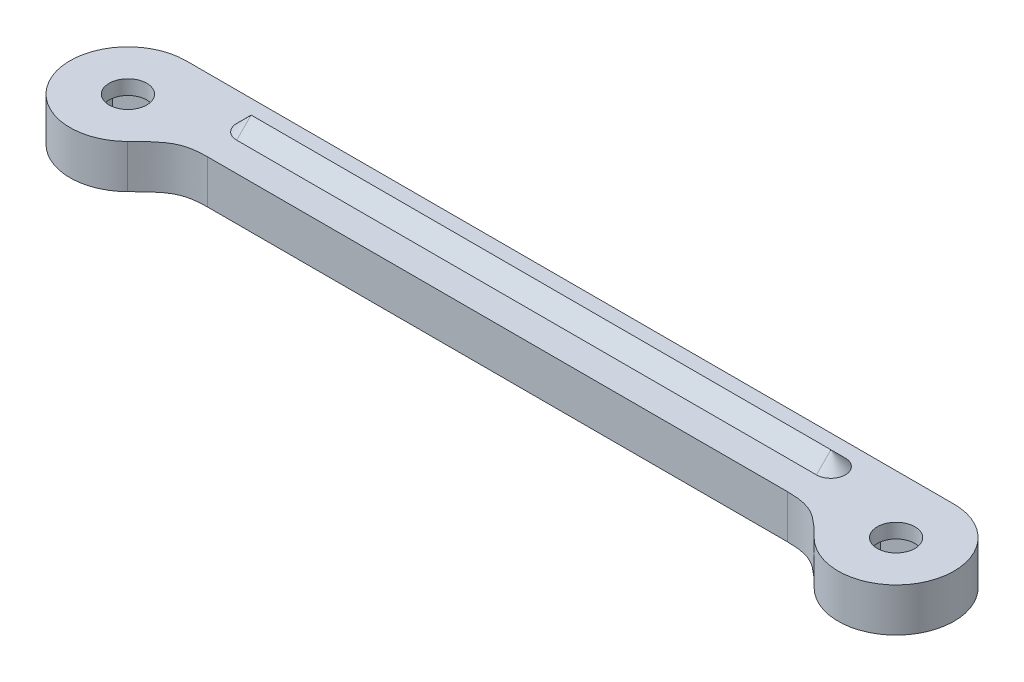
ISO-10303-21;
HEADER;
FILE_DESCRIPTION(('STEP AP214'),'2;1');
FILE_NAME('part.step','',(''),(''),'','','');
FILE_SCHEMA(('AUTOMOTIVE_DESIGN { 1 0 10303 214 1 1 1 1 }'));
ENDSEC;
DATA;
#1=APPLICATION_CONTEXT('core data for automotive mechanical design processes');
#2=APPLICATION_PROTOCOL_DEFINITION('international standard','automotive_design',2000,#1);
#3=PRODUCT_CONTEXT('',#1,'mechanical');
#4=PRODUCT('Part','Part','',(#3));
#5=PRODUCT_RELATED_PRODUCT_CATEGORY('part','',(#4));
#6=PRODUCT_DEFINITION_FORMATION('','',#4);
#7=PRODUCT_DEFINITION_CONTEXT('part definition',#1,'design');
#8=PRODUCT_DEFINITION('design','',#6,#7);
#9=PRODUCT_DEFINITION_SHAPE('','',#8);
#10=(LENGTH_UNIT() NAMED_UNIT(*) SI_UNIT(.MILLI.,.METRE.));
#11=(NAMED_UNIT(*) PLANE_ANGLE_UNIT() SI_UNIT($,.RADIAN.));
#12=(NAMED_UNIT(*) SI_UNIT($,.STERADIAN.) SOLID_ANGLE_UNIT());
#13=UNCERTAINTY_MEASURE_WITH_UNIT(LENGTH_MEASURE(1.E-05),#10,'distance_accuracy_value','');
#14=(GEOMETRIC_REPRESENTATION_CONTEXT(3) GLOBAL_UNCERTAINTY_ASSIGNED_CONTEXT((#13)) GLOBAL_UNIT_ASSIGNED_CONTEXT((#10,
#11,#12)) REPRESENTATION_CONTEXT('',''));
#15=CARTESIAN_POINT('',(0.,0.,0.));
#16=DIRECTION('',(0.,0.,1.));
#17=DIRECTION('',(1.,0.,0.));
#18=AXIS2_PLACEMENT_3D('',#15,#16,#17);
#19=CARTESIAN_POINT('',(26.5,3.,0.));
#20=DIRECTION('',(0.,-1.,0.));
#21=DIRECTION('',(0.,0.,-1.));
#22=AXIS2_PLACEMENT_3D('',#19,#20,#21);
#23=CYLINDRICAL_SURFACE('',#22,1.3);
#24=CARTESIAN_POINT('',(26.5,3.,0.));
#25=DIRECTION('',(0.,1.,0.));
#26=DIRECTION('',(0.,0.,-1.));
#27=AXIS2_PLACEMENT_3D('',#24,#25,#26);
#28=CIRCLE('',#27,1.3);
#29=CARTESIAN_POINT('',(26.5,3.,-1.3));
#30=VERTEX_POINT('',#29);
#31=EDGE_CURVE('E313',#30,#30,#28,.T.);
#32=ORIENTED_EDGE('',*,*,#31,.T.);
#33=EDGE_LOOP('',(#32));
#34=FACE_BOUND('',#33,.T.);
#35=CARTESIAN_POINT('',(26.5,2.,0.));
#36=DIRECTION('',(0.,-1.,0.));
#37=DIRECTION('',(0.,0.,-1.));
#38=AXIS2_PLACEMENT_3D('',#35,#36,#37);
#39=CIRCLE('',#38,1.3);
#40=CARTESIAN_POINT('',(26.5,2.,-1.3));
#41=VERTEX_POINT('',#40);
#42=EDGE_CURVE('E41',#41,#41,#39,.T.);
#43=ORIENTED_EDGE('',*,*,#42,.T.);
#44=EDGE_LOOP('',(#43));
#45=FACE_BOUND('',#44,.T.);
#46=ADVANCED_FACE('F36',(#34,#45),#23,.F.);
#47=CARTESIAN_POINT('',(-26.5,3.,0.));
#48=DIRECTION('',(0.,-1.,0.));
#49=DIRECTION('',(0.,0.,-1.));
#50=AXIS2_PLACEMENT_3D('',#47,#48,#49);
#51=CYLINDRICAL_SURFACE('',#50,1.3);
#52=CARTESIAN_POINT('',(-26.5,3.,0.));
#53=DIRECTION('',(0.,1.,0.));
#54=DIRECTION('',(0.,0.,1.));
#55=AXIS2_PLACEMENT_3D('',#52,#53,#54);
#56=CIRCLE('',#55,1.3);
#57=CARTESIAN_POINT('',(-26.5,3.,1.3));
#58=VERTEX_POINT('',#57);
#59=EDGE_CURVE('E306',#58,#58,#56,.T.);
#60=ORIENTED_EDGE('',*,*,#59,.T.);
#61=EDGE_LOOP('',(#60));
#62=FACE_BOUND('',#61,.T.);
#63=CARTESIAN_POINT('',(-26.5,2.,0.));
#64=DIRECTION('',(0.,-1.,0.));
#65=DIRECTION('',(0.,0.,-1.));
#66=AXIS2_PLACEMENT_3D('',#63,#64,#65);
#67=CIRCLE('',#66,1.3);
#68=CARTESIAN_POINT('',(-26.5,2.,-1.3));
#69=VERTEX_POINT('',#68);
#70=EDGE_CURVE('E219',#69,#69,#67,.T.);
#71=ORIENTED_EDGE('',*,*,#70,.T.);
#72=EDGE_LOOP('',(#71));
#73=FACE_BOUND('',#72,.T.);
#74=ADVANCED_FACE('F353',(#62,#73),#51,.F.);
#75=CARTESIAN_POINT('',(-22.1102027769377,3.,1.47947070076591));
#76=DIRECTION('',(0.,-1.,0.));
#77=DIRECTION('',(0.,0.,-1.));
#78=AXIS2_PLACEMENT_3D('',#75,#76,#77);
#79=PLANE('',#78);
#80=DIRECTION('',(-1.,0.,0.));
#81=VECTOR('',#80,1.);
#82=CARTESIAN_POINT('',(-22.1102027769377,3.,-3.));
#83=LINE('',#82,#81);
#84=CARTESIAN_POINT('',(20.,3.,-3.));
#85=VERTEX_POINT('',#84);
#86=CARTESIAN_POINT('',(-20.,3.,-3.));
#87=VERTEX_POINT('',#86);
#88=EDGE_CURVE('E293',#85,#87,#83,.T.);
#89=ORIENTED_EDGE('',*,*,#88,.F.);
#90=CARTESIAN_POINT('',(20.,3.,-1.99999999999999));
#91=DIRECTION('',(0.,-1.,0.));
#92=DIRECTION('',(0.,0.,-1.));
#93=AXIS2_PLACEMENT_3D('',#90,#91,#92);
#94=CIRCLE('',#93,1.00000000000001);
#95=CARTESIAN_POINT('',(20.,3.,-0.999999999999976));
#96=VERTEX_POINT('',#95);
#97=EDGE_CURVE('E286',#85,#96,#94,.T.);
#98=ORIENTED_EDGE('',*,*,#97,.T.);
#99=DIRECTION('',(1.,0.,0.));
#100=VECTOR('',#99,1.);
#101=CARTESIAN_POINT('',(-22.1102027769377,3.,-0.999999999999976));
#102=LINE('',#101,#100);
#103=CARTESIAN_POINT('',(-20.,3.,-0.999999999999977));
#104=VERTEX_POINT('',#103);
#105=EDGE_CURVE('E288',#104,#96,#102,.T.);
#106=ORIENTED_EDGE('',*,*,#105,.F.);
#107=CARTESIAN_POINT('',(-20.,3.,-1.99999999999999));
#108=DIRECTION('',(0.,-1.,0.));
#109=DIRECTION('',(0.,0.,-1.));
#110=AXIS2_PLACEMENT_3D('',#107,#108,#109);
#111=CIRCLE('',#110,1.00000000000001);
#112=EDGE_CURVE('E291',#104,#87,#111,.T.);
#113=ORIENTED_EDGE('',*,*,#112,.T.);
#114=EDGE_LOOP('',(#89,#98,#106,#113));
#115=FACE_BOUND('',#114,.T.);
#116=CARTESIAN_POINT('',(-23.6790489014212,3.,2.83588344249673));
#117=CARTESIAN_POINT('',(-23.0934719443906,3.,2.25338984086143));
#118=CARTESIAN_POINT('',(-22.2025038933331,3.,1.39470061798226));
#119=CARTESIAN_POINT('',(-21.147870258469,3.,1.00000000000001));
#120=CARTESIAN_POINT('',(-20.,3.,1.00000000000001));
#121=B_SPLINE_CURVE_WITH_KNOTS('',3,(#116,#117,#118,#119,#120),.UNSPECIFIED.,.F.,.F.,(4,1,4),
(0.,0.448073872389922,1.),.UNSPECIFIED.);
#122=CARTESIAN_POINT('',(-23.6790489014212,3.,2.83588344249673));
#123=VERTEX_POINT('',#122);
#124=CARTESIAN_POINT('',(-20.,3.,1.00000000000001));
#125=VERTEX_POINT('',#124);
#126=EDGE_CURVE('E316',#123,#125,#121,.T.);
#127=ORIENTED_EDGE('',*,*,#126,.T.);
#128=DIRECTION('',(1.,0.,0.));
#129=VECTOR('',#128,1.);
#130=CARTESIAN_POINT('',(-20.,3.,1.00000000000001));
#131=LINE('',#130,#129);
#132=CARTESIAN_POINT('',(20.,3.,1.));
#133=VERTEX_POINT('',#132);
#134=EDGE_CURVE('E322',#125,#133,#131,.T.);
#135=ORIENTED_EDGE('',*,*,#134,.T.);
#136=CARTESIAN_POINT('',(20.,3.,1.00000000000001));
#137=CARTESIAN_POINT('',(21.147870258469,3.,1.00000000000001));
#138=CARTESIAN_POINT('',(22.2025038933331,3.,1.39470061798226));
#139=CARTESIAN_POINT('',(23.0934719443906,3.,2.25338984086143));
#140=CARTESIAN_POINT('',(23.6790489014212,3.,2.83588344249673));
#141=B_SPLINE_CURVE_WITH_KNOTS('',3,(#136,#137,#138,#139,#140),.UNSPECIFIED.,.F.,.F.,(4,1,4),
(0.,0.551926127610078,1.),.UNSPECIFIED.);
#142=CARTESIAN_POINT('',(23.6790489014212,3.,2.83588344249673));
#143=VERTEX_POINT('',#142);
#144=EDGE_CURVE('E328',#133,#143,#141,.T.);
#145=ORIENTED_EDGE('',*,*,#144,.T.);
#146=CARTESIAN_POINT('',(26.5,3.,0.));
#147=DIRECTION('',(0.,1.,0.));
#148=DIRECTION('',(0.,0.,-1.));
#149=AXIS2_PLACEMENT_3D('',#146,#147,#148);
#150=CIRCLE('',#149,3.99999999999992);
#151=CARTESIAN_POINT('',(26.5,3.,-3.99999999999992));
#152=VERTEX_POINT('',#151);
#153=EDGE_CURVE('E333',#143,#152,#150,.T.);
#154=ORIENTED_EDGE('',*,*,#153,.T.);
#155=DIRECTION('',(-1.,0.,0.));
#156=VECTOR('',#155,1.);
#157=CARTESIAN_POINT('',(-26.5,3.,-4.));
#158=LINE('',#157,#156);
#159=CARTESIAN_POINT('',(-26.5,3.,-4.));
#160=VERTEX_POINT('',#159);
#161=EDGE_CURVE('E490',#152,#160,#158,.T.);
#162=ORIENTED_EDGE('',*,*,#161,.T.);
#163=CARTESIAN_POINT('',(-26.5,3.,0.));
#164=DIRECTION('',(0.,1.,0.));
#165=DIRECTION('',(0.,0.,1.));
#166=AXIS2_PLACEMENT_3D('',#163,#164,#165);
#167=CIRCLE('',#166,4.);
#168=EDGE_CURVE('E398',#160,#123,#167,.T.);
#169=ORIENTED_EDGE('',*,*,#168,.T.);
#170=EDGE_LOOP('',(#127,#135,#145,#154,#162,#169));
#171=FACE_BOUND('',#170,.T.);
#172=ORIENTED_EDGE('',*,*,#31,.F.);
#173=EDGE_LOOP('',(#172));
#174=FACE_BOUND('',#173,.T.);
#175=ORIENTED_EDGE('',*,*,#59,.F.);
#176=EDGE_LOOP('',(#175));
#177=FACE_BOUND('',#176,.T.);
#178=ADVANCED_FACE('F359',(#115,#171,#174,#177),#79,.F.);
#179=CARTESIAN_POINT('',(-22.1102027769377,0.,1.47947070076591));
#180=DIRECTION('',(0.,-1.,0.));
#181=DIRECTION('',(0.,0.,-1.));
#182=AXIS2_PLACEMENT_3D('',#179,#180,#181);
#183=PLANE('',#182);
#184=DIRECTION('',(0.,0.,1.));
#185=VECTOR('',#184,1.);
#186=CARTESIAN_POINT('',(-24.,0.,-1.44337567297407));
#187=LINE('',#186,#185);
#188=CARTESIAN_POINT('',(-24.,0.,-1.44337567297407));
#189=VERTEX_POINT('',#188);
#190=CARTESIAN_POINT('',(-24.,0.,1.44337567297407));
#191=VERTEX_POINT('',#190);
#192=EDGE_CURVE('E54',#189,#191,#187,.T.);
#193=ORIENTED_EDGE('',*,*,#192,.F.);
#194=DIRECTION('',(0.866025403784439,0.,0.5));
#195=VECTOR('',#194,1.);
#196=CARTESIAN_POINT('',(-26.5,0.,-2.88675134594813));
#197=LINE('',#196,#195);
#198=CARTESIAN_POINT('',(-26.5,0.,-2.88675134594813));
#199=VERTEX_POINT('',#198);
#200=EDGE_CURVE('E213',#199,#189,#197,.T.);
#201=ORIENTED_EDGE('',*,*,#200,.F.);
#202=DIRECTION('',(0.866025403784439,0.,-0.5));
#203=VECTOR('',#202,1.);
#204=CARTESIAN_POINT('',(-29.,0.,-1.44337567297406));
#205=LINE('',#204,#203);
#206=CARTESIAN_POINT('',(-29.,0.,-1.44337567297406));
#207=VERTEX_POINT('',#206);
#208=EDGE_CURVE('E207',#207,#199,#205,.T.);
#209=ORIENTED_EDGE('',*,*,#208,.F.);
#210=DIRECTION('',(0.,0.,-1.));
#211=VECTOR('',#210,1.);
#212=CARTESIAN_POINT('',(-29.,0.,1.44337567297407));
#213=LINE('',#212,#211);
#214=CARTESIAN_POINT('',(-29.,0.,1.44337567297407));
#215=VERTEX_POINT('',#214);
#216=EDGE_CURVE('E205',#215,#207,#213,.T.);
#217=ORIENTED_EDGE('',*,*,#216,.F.);
#218=DIRECTION('',(-0.866025403784439,0.,-0.5));
#219=VECTOR('',#218,1.);
#220=CARTESIAN_POINT('',(-26.5,0.,2.88675134594813));
#221=LINE('',#220,#219);
#222=CARTESIAN_POINT('',(-26.5,0.,2.88675134594813));
#223=VERTEX_POINT('',#222);
#224=EDGE_CURVE('E186',#223,#215,#221,.T.);
#225=ORIENTED_EDGE('',*,*,#224,.F.);
#226=DIRECTION('',(-0.866025403784439,0.,0.5));
#227=VECTOR('',#226,1.);
#228=CARTESIAN_POINT('',(-24.,0.,1.44337567297407));
#229=LINE('',#228,#227);
#230=EDGE_CURVE('E197',#191,#223,#229,.T.);
#231=ORIENTED_EDGE('',*,*,#230,.F.);
#232=EDGE_LOOP('',(#193,#201,#209,#217,#225,#231));
#233=FACE_BOUND('',#232,.T.);
#234=DIRECTION('',(0.,0.,1.));
#235=VECTOR('',#234,1.);
#236=CARTESIAN_POINT('',(29.,0.,-1.44337567297406));
#237=LINE('',#236,#235);
#238=CARTESIAN_POINT('',(29.,0.,-1.44337567297406));
#239=VERTEX_POINT('',#238);
#240=CARTESIAN_POINT('',(29.,0.,1.44337567297407));
#241=VERTEX_POINT('',#240);
#242=EDGE_CURVE('E62',#239,#241,#237,.T.);
#243=ORIENTED_EDGE('',*,*,#242,.F.);
#244=DIRECTION('',(0.866025403784438,0.,0.500000000000001));
#245=VECTOR('',#244,1.);
#246=CARTESIAN_POINT('',(26.5,0.,-2.88675134594812));
#247=LINE('',#246,#245);
#248=CARTESIAN_POINT('',(26.5,0.,-2.88675134594812));
#249=VERTEX_POINT('',#248);
#250=EDGE_CURVE('E253',#249,#239,#247,.T.);
#251=ORIENTED_EDGE('',*,*,#250,.F.);
#252=DIRECTION('',(0.866025403784439,0.,-0.5));
#253=VECTOR('',#252,1.);
#254=CARTESIAN_POINT('',(24.,0.,-1.44337567297407));
#255=LINE('',#254,#253);
#256=CARTESIAN_POINT('',(24.,0.,-1.44337567297407));
#257=VERTEX_POINT('',#256);
#258=EDGE_CURVE('E250',#257,#249,#255,.T.);
#259=ORIENTED_EDGE('',*,*,#258,.F.);
#260=DIRECTION('',(0.,0.,-1.));
#261=VECTOR('',#260,1.);
#262=CARTESIAN_POINT('',(24.,0.,1.44337567297406));
#263=LINE('',#262,#261);
#264=CARTESIAN_POINT('',(24.,0.,1.44337567297406));
#265=VERTEX_POINT('',#264);
#266=EDGE_CURVE('E247',#265,#257,#263,.T.);
#267=ORIENTED_EDGE('',*,*,#266,.F.);
#268=DIRECTION('',(-0.866025403784438,0.,-0.500000000000001));
#269=VECTOR('',#268,1.);
#270=CARTESIAN_POINT('',(26.5,0.,2.88675134594813));
#271=LINE('',#270,#269);
#272=CARTESIAN_POINT('',(26.5,0.,2.88675134594813));
#273=VERTEX_POINT('',#272);
#274=EDGE_CURVE('E244',#273,#265,#271,.T.);
#275=ORIENTED_EDGE('',*,*,#274,.F.);
#276=DIRECTION('',(-0.866025403784439,0.,0.5));
#277=VECTOR('',#276,1.);
#278=CARTESIAN_POINT('',(29.,0.,1.44337567297406));
#279=LINE('',#278,#277);
#280=EDGE_CURVE('E241',#241,#273,#279,.T.);
#281=ORIENTED_EDGE('',*,*,#280,.F.);
#282=EDGE_LOOP('',(#243,#251,#259,#267,#275,#281));
#283=FACE_BOUND('',#282,.T.);
#284=CARTESIAN_POINT('',(-23.6790489014212,0.,2.83588344249673));
#285=CARTESIAN_POINT('',(-23.0934719443906,0.,2.25338984086143));
#286=CARTESIAN_POINT('',(-22.2025038933331,0.,1.39470061798226));
#287=CARTESIAN_POINT('',(-21.147870258469,0.,1.00000000000001));
#288=CARTESIAN_POINT('',(-20.,0.,1.00000000000001));
#289=B_SPLINE_CURVE_WITH_KNOTS('',3,(#284,#285,#286,#287,#288),.UNSPECIFIED.,.F.,.F.,(4,1,4),
(0.,0.448073872389922,1.),.UNSPECIFIED.);
#290=CARTESIAN_POINT('',(-23.6790489014212,0.,2.83588344249673));
#291=VERTEX_POINT('',#290);
#292=CARTESIAN_POINT('',(-20.,0.,1.00000000000001));
#293=VERTEX_POINT('',#292);
#294=EDGE_CURVE('E315',#291,#293,#289,.T.);
#295=ORIENTED_EDGE('',*,*,#294,.F.);
#296=CARTESIAN_POINT('',(-26.5,0.,0.));
#297=DIRECTION('',(0.,1.,0.));
#298=DIRECTION('',(0.,0.,1.));
#299=AXIS2_PLACEMENT_3D('',#296,#297,#298);
#300=CIRCLE('',#299,4.);
#301=CARTESIAN_POINT('',(-26.5,0.,-4.));
#302=VERTEX_POINT('',#301);
#303=EDGE_CURVE('E323',#302,#291,#300,.T.);
#304=ORIENTED_EDGE('',*,*,#303,.F.);
#305=DIRECTION('',(-1.,0.,0.));
#306=VECTOR('',#305,1.);
#307=CARTESIAN_POINT('',(-26.5,0.,-4.));
#308=LINE('',#307,#306);
#309=CARTESIAN_POINT('',(26.5,0.,-3.99999999999992));
#310=VERTEX_POINT('',#309);
#311=EDGE_CURVE('E384',#310,#302,#308,.T.);
#312=ORIENTED_EDGE('',*,*,#311,.F.);
#313=CARTESIAN_POINT('',(26.5,0.,0.));
#314=DIRECTION('',(0.,1.,0.));
#315=DIRECTION('',(0.,0.,-1.));
#316=AXIS2_PLACEMENT_3D('',#313,#314,#315);
#317=CIRCLE('',#316,3.99999999999992);
#318=CARTESIAN_POINT('',(23.6790489014212,0.,2.83588344249673));
#319=VERTEX_POINT('',#318);
#320=EDGE_CURVE('E394',#319,#310,#317,.T.);
#321=ORIENTED_EDGE('',*,*,#320,.F.);
#322=CARTESIAN_POINT('',(20.,0.,1.00000000000001));
#323=CARTESIAN_POINT('',(21.147870258469,0.,1.00000000000001));
#324=CARTESIAN_POINT('',(22.2025038933331,0.,1.39470061798226));
#325=CARTESIAN_POINT('',(23.0934719443906,0.,2.25338984086143));
#326=CARTESIAN_POINT('',(23.6790489014212,0.,2.83588344249673));
#327=B_SPLINE_CURVE_WITH_KNOTS('',3,(#322,#323,#324,#325,#326),.UNSPECIFIED.,.F.,.F.,(4,1,4),
(0.,0.551926127610078,1.),.UNSPECIFIED.);
#328=CARTESIAN_POINT('',(20.,0.,1.));
#329=VERTEX_POINT('',#328);
#330=EDGE_CURVE('E500',#329,#319,#327,.T.);
#331=ORIENTED_EDGE('',*,*,#330,.F.);
#332=DIRECTION('',(1.,0.,0.));
#333=VECTOR('',#332,1.);
#334=CARTESIAN_POINT('',(-20.,0.,1.00000000000001));
#335=LINE('',#334,#333);
#336=EDGE_CURVE('E485',#293,#329,#335,.T.);
#337=ORIENTED_EDGE('',*,*,#336,.F.);
#338=EDGE_LOOP('',(#295,#304,#312,#321,#331,#337));
#339=FACE_BOUND('',#338,.T.);
#340=ADVANCED_FACE('F201',(#233,#283,#339),#183,.T.);
#341=DIRECTION('',(0.,-1.,0.));
#342=VECTOR('',#341,1.);
#343=SURFACE_OF_LINEAR_EXTRUSION('',#121,#342);
#344=ORIENTED_EDGE('',*,*,#294,.T.);
#345=DIRECTION('',(0.,-1.,0.));
#346=VECTOR('',#345,1.);
#347=CARTESIAN_POINT('',(-20.,3.,1.00000000000001));
#348=LINE('',#347,#346);
#349=EDGE_CURVE('E11',#125,#293,#348,.T.);
#350=ORIENTED_EDGE('',*,*,#349,.F.);
#351=ORIENTED_EDGE('',*,*,#126,.F.);
#352=DIRECTION('',(0.,-1.,0.));
#353=VECTOR('',#352,1.);
#354=CARTESIAN_POINT('',(-23.6790489014212,3.,2.83588344249673));
#355=LINE('',#354,#353);
#356=EDGE_CURVE('E399',#123,#291,#355,.T.);
#357=ORIENTED_EDGE('',*,*,#356,.T.);
#358=EDGE_LOOP('',(#344,#350,#351,#357));
#359=FACE_BOUND('',#358,.T.);
#360=ADVANCED_FACE('F38',(#359),#343,.F.);
#361=CARTESIAN_POINT('',(-20.,3.,1.00000000000001));
#362=DIRECTION('',(0.,0.,-1.));
#363=DIRECTION('',(-1.,0.,0.));
#364=AXIS2_PLACEMENT_3D('',#361,#362,#363);
#365=PLANE('',#364);
#366=ORIENTED_EDGE('',*,*,#336,.T.);
#367=DIRECTION('',(0.,-1.,0.));
#368=VECTOR('',#367,1.);
#369=CARTESIAN_POINT('',(20.,3.,1.));
#370=LINE('',#369,#368);
#371=EDGE_CURVE('E46',#133,#329,#370,.T.);
#372=ORIENTED_EDGE('',*,*,#371,.F.);
#373=ORIENTED_EDGE('',*,*,#134,.F.);
#374=ORIENTED_EDGE('',*,*,#349,.T.);
#375=EDGE_LOOP('',(#366,#372,#373,#374));
#376=FACE_BOUND('',#375,.T.);
#377=ADVANCED_FACE('F343',(#376),#365,.F.);
#378=DIRECTION('',(0.,-1.,0.));
#379=VECTOR('',#378,1.);
#380=SURFACE_OF_LINEAR_EXTRUSION('',#141,#379);
#381=ORIENTED_EDGE('',*,*,#330,.T.);
#382=DIRECTION('',(0.,-1.,0.));
#383=VECTOR('',#382,1.);
#384=CARTESIAN_POINT('',(23.6790489014212,3.,2.83588344249673));
#385=LINE('',#384,#383);
#386=EDGE_CURVE('E408',#143,#319,#385,.T.);
#387=ORIENTED_EDGE('',*,*,#386,.F.);
#388=ORIENTED_EDGE('',*,*,#144,.F.);
#389=ORIENTED_EDGE('',*,*,#371,.T.);
#390=EDGE_LOOP('',(#381,#387,#388,#389));
#391=FACE_BOUND('',#390,.T.);
#392=ADVANCED_FACE('F339',(#391),#380,.F.);
#393=CARTESIAN_POINT('',(26.5,3.,0.));
#394=DIRECTION('',(0.,-1.,0.));
#395=DIRECTION('',(0.,0.,-1.));
#396=AXIS2_PLACEMENT_3D('',#393,#394,#395);
#397=CYLINDRICAL_SURFACE('',#396,3.99999999999992);
#398=ORIENTED_EDGE('',*,*,#320,.T.);
#399=DIRECTION('',(0.,-1.,0.));
#400=VECTOR('',#399,1.);
#401=CARTESIAN_POINT('',(26.5,3.,-3.99999999999992));
#402=LINE('',#401,#400);
#403=EDGE_CURVE('E390',#152,#310,#402,.T.);
#404=ORIENTED_EDGE('',*,*,#403,.F.);
#405=ORIENTED_EDGE('',*,*,#153,.F.);
#406=ORIENTED_EDGE('',*,*,#386,.T.);
#407=EDGE_LOOP('',(#398,#404,#405,#406));
#408=FACE_BOUND('',#407,.T.);
#409=ADVANCED_FACE('F342',(#408),#397,.T.);
#410=CARTESIAN_POINT('',(-26.5,3.,-4.));
#411=DIRECTION('',(0.,0.,1.));
#412=DIRECTION('',(1.,0.,0.));
#413=AXIS2_PLACEMENT_3D('',#410,#411,#412);
#414=PLANE('',#413);
#415=ORIENTED_EDGE('',*,*,#311,.T.);
#416=DIRECTION('',(0.,-1.,0.));
#417=VECTOR('',#416,1.);
#418=CARTESIAN_POINT('',(-26.5,3.,-4.));
#419=LINE('',#418,#417);
#420=EDGE_CURVE('E387',#160,#302,#419,.T.);
#421=ORIENTED_EDGE('',*,*,#420,.F.);
#422=ORIENTED_EDGE('',*,*,#161,.F.);
#423=ORIENTED_EDGE('',*,*,#403,.T.);
#424=EDGE_LOOP('',(#415,#421,#422,#423));
#425=FACE_BOUND('',#424,.T.);
#426=ADVANCED_FACE('F373',(#425),#414,.F.);
#427=CARTESIAN_POINT('',(-26.5,3.,0.));
#428=DIRECTION('',(0.,-1.,0.));
#429=DIRECTION('',(0.,0.,-1.));
#430=AXIS2_PLACEMENT_3D('',#427,#428,#429);
#431=CYLINDRICAL_SURFACE('',#430,4.);
#432=ORIENTED_EDGE('',*,*,#303,.T.);
#433=ORIENTED_EDGE('',*,*,#356,.F.);
#434=ORIENTED_EDGE('',*,*,#168,.F.);
#435=ORIENTED_EDGE('',*,*,#420,.T.);
#436=EDGE_LOOP('',(#432,#433,#434,#435));
#437=FACE_BOUND('',#436,.T.);
#438=ADVANCED_FACE('F370',(#437),#431,.T.);
#439=CARTESIAN_POINT('',(20.,3.,-1.99999999999999));
#440=DIRECTION('',(0.,-1.,0.));
#441=DIRECTION('',(0.,0.,-1.));
#442=AXIS2_PLACEMENT_3D('',#439,#440,#441);
#443=CONICAL_SURFACE('',#442,1.00000000000001,0.78539816339745);
#444=DIRECTION('',(0.,-0.707106781186546,-0.707106781186549));
#445=VECTOR('',#444,1.);
#446=CARTESIAN_POINT('',(20.,3.,-3.));
#447=LINE('',#446,#445);
#448=CARTESIAN_POINT('',(20.,4.00000000000001,-1.99999999999999));
#449=VERTEX_POINT('',#448);
#450=EDGE_CURVE('E297',#449,#85,#447,.T.);
#451=ORIENTED_EDGE('',*,*,#450,.F.);
#452=DIRECTION('',(0.,-0.707106781186546,0.707106781186549));
#453=VECTOR('',#452,1.);
#454=CARTESIAN_POINT('',(20.,3.,-0.999999999999976));
#455=LINE('',#454,#453);
#456=EDGE_CURVE('E296',#449,#96,#455,.T.);
#457=ORIENTED_EDGE('',*,*,#456,.T.);
#458=ORIENTED_EDGE('',*,*,#97,.F.);
#459=EDGE_LOOP('',(#451,#457,#458));
#460=FACE_BOUND('',#459,.T.);
#461=ADVANCED_FACE('F372',(#460),#443,.T.);
#462=CARTESIAN_POINT('',(-22.1102027769377,3.,-3.));
#463=DIRECTION('',(0.,0.707106781186549,-0.707106781186546));
#464=DIRECTION('',(0.,0.707106781186546,0.707106781186549));
#465=AXIS2_PLACEMENT_3D('',#462,#463,#464);
#466=PLANE('',#465);
#467=ORIENTED_EDGE('',*,*,#88,.T.);
#468=DIRECTION('',(0.,-0.707106781186546,-0.707106781186549));
#469=VECTOR('',#468,1.);
#470=CARTESIAN_POINT('',(-20.,3.,-3.));
#471=LINE('',#470,#469);
#472=CARTESIAN_POINT('',(-20.,4.00000000000001,-1.99999999999999));
#473=VERTEX_POINT('',#472);
#474=EDGE_CURVE('E301',#473,#87,#471,.T.);
#475=ORIENTED_EDGE('',*,*,#474,.F.);
#476=DIRECTION('',(1.,0.,0.));
#477=VECTOR('',#476,1.);
#478=CARTESIAN_POINT('',(-22.1102027769377,4.00000000000001,-1.99999999999999));
#479=LINE('',#478,#477);
#480=EDGE_CURVE('E300',#473,#449,#479,.T.);
#481=ORIENTED_EDGE('',*,*,#480,.T.);
#482=ORIENTED_EDGE('',*,*,#450,.T.);
#483=EDGE_LOOP('',(#467,#475,#481,#482));
#484=FACE_BOUND('',#483,.T.);
#485=ADVANCED_FACE('F457',(#484),#466,.T.);
#486=CARTESIAN_POINT('',(-20.,3.,-1.99999999999999));
#487=DIRECTION('',(0.,-1.,0.));
#488=DIRECTION('',(0.,0.,-1.));
#489=AXIS2_PLACEMENT_3D('',#486,#487,#488);
#490=CONICAL_SURFACE('',#489,1.00000000000001,0.78539816339745);
#491=DIRECTION('',(0.,-0.707106781186546,0.707106781186549));
#492=VECTOR('',#491,1.);
#493=CARTESIAN_POINT('',(-20.,3.,-0.999999999999977));
#494=LINE('',#493,#492);
#495=EDGE_CURVE('E304',#473,#104,#494,.T.);
#496=ORIENTED_EDGE('',*,*,#495,.F.);
#497=ORIENTED_EDGE('',*,*,#474,.T.);
#498=ORIENTED_EDGE('',*,*,#112,.F.);
#499=EDGE_LOOP('',(#496,#497,#498));
#500=FACE_BOUND('',#499,.T.);
#501=ADVANCED_FACE('F463',(#500),#490,.T.);
#502=CARTESIAN_POINT('',(-22.1102027769377,3.,-0.999999999999976));
#503=DIRECTION('',(0.,0.707106781186549,0.707106781186546));
#504=DIRECTION('',(0.,-0.707106781186546,0.707106781186549));
#505=AXIS2_PLACEMENT_3D('',#502,#503,#504);
#506=PLANE('',#505);
#507=ORIENTED_EDGE('',*,*,#105,.T.);
#508=ORIENTED_EDGE('',*,*,#456,.F.);
#509=ORIENTED_EDGE('',*,*,#480,.F.);
#510=ORIENTED_EDGE('',*,*,#495,.T.);
#511=EDGE_LOOP('',(#507,#508,#509,#510));
#512=FACE_BOUND('',#511,.T.);
#513=ADVANCED_FACE('F459',(#512),#506,.T.);
#514=CARTESIAN_POINT('',(-24.,0.,-1.44337567297407));
#515=DIRECTION('',(0.996194698091746,-0.0871557427476584,0.));
#516=DIRECTION('',(0.0871557427476584,0.996194698091746,0.));
#517=AXIS2_PLACEMENT_3D('',#514,#515,#516);
#518=PLANE('',#517);
#519=ORIENTED_EDGE('',*,*,#192,.T.);
#520=DIRECTION('',(-0.0870456108832093,-0.994935885120892,-0.0502558068751963));
#521=VECTOR('',#520,1.);
#522=CARTESIAN_POINT('',(-24.0126282306234,-0.144341336516625,1.43608476062427));
#523=LINE('',#522,#521);
#524=CARTESIAN_POINT('',(-23.8250226729482,2.,1.54439887984954));
#525=VERTEX_POINT('',#524);
#526=EDGE_CURVE('E194',#525,#191,#523,.T.);
#527=ORIENTED_EDGE('',*,*,#526,.F.);
#528=DIRECTION('',(0.,0.,1.));
#529=VECTOR('',#528,1.);
#530=CARTESIAN_POINT('',(-23.8250226729482,2.,0.));
#531=LINE('',#530,#529);
#532=CARTESIAN_POINT('',(-23.8250226729482,2.,-1.54439887984954));
#533=VERTEX_POINT('',#532);
#534=EDGE_CURVE('E216',#533,#525,#531,.T.);
#535=ORIENTED_EDGE('',*,*,#534,.F.);
#536=DIRECTION('',(-0.0870456108832093,-0.994935885120892,0.0502558068751963));
#537=VECTOR('',#536,1.);
#538=CARTESIAN_POINT('',(-24.0126282306234,-0.144341336516624,-1.43608476062427));
#539=LINE('',#538,#537);
#540=EDGE_CURVE('E217',#533,#189,#539,.T.);
#541=ORIENTED_EDGE('',*,*,#540,.T.);
#542=EDGE_LOOP('',(#519,#527,#535,#541));
#543=FACE_BOUND('',#542,.T.);
#544=ADVANCED_FACE('F462',(#543),#518,.F.);
#545=CARTESIAN_POINT('',(-26.5,0.,-2.88675134594813));
#546=DIRECTION('',(0.498097349045873,-0.0871557427476584,-0.862729915662821));
#547=DIRECTION('',(-0.866025403784439,0.,-0.5));
#548=AXIS2_PLACEMENT_3D('',#545,#546,#547);
#549=PLANE('',#548);
#550=ORIENTED_EDGE('',*,*,#200,.T.);
#551=ORIENTED_EDGE('',*,*,#540,.F.);
#552=DIRECTION('',(0.866025403784439,0.,0.5));
#553=VECTOR('',#552,1.);
#554=CARTESIAN_POINT('',(-5.28751133647407,2.,9.15823828036951));
#555=LINE('',#554,#553);
#556=CARTESIAN_POINT('',(-26.5,2.,-3.08879775969906));
#557=VERTEX_POINT('',#556);
#558=EDGE_CURVE('E221',#557,#533,#555,.T.);
#559=ORIENTED_EDGE('',*,*,#558,.F.);
#560=DIRECTION('',(0.,-0.994935885120892,0.100511613750393));
#561=VECTOR('',#560,1.);
#562=CARTESIAN_POINT('',(-26.5,-0.144341336516625,-2.87216952124853));
#563=LINE('',#562,#561);
#564=EDGE_CURVE('E220',#557,#199,#563,.T.);
#565=ORIENTED_EDGE('',*,*,#564,.T.);
#566=EDGE_LOOP('',(#550,#551,#559,#565));
#567=FACE_BOUND('',#566,.T.);
#568=ADVANCED_FACE('F522',(#567),#549,.F.);
#569=CARTESIAN_POINT('',(-29.,0.,-1.44337567297406));
#570=DIRECTION('',(-0.498097349045873,-0.0871557427476584,-0.862729915662821));
#571=DIRECTION('',(-0.866025403784439,0.,0.5));
#572=AXIS2_PLACEMENT_3D('',#569,#570,#571);
#573=PLANE('',#572);
#574=ORIENTED_EDGE('',*,*,#208,.T.);
#575=ORIENTED_EDGE('',*,*,#564,.F.);
#576=DIRECTION('',(0.866025403784439,0.,-0.5));
#577=VECTOR('',#576,1.);
#578=CARTESIAN_POINT('',(-7.96248866352592,2.,-13.7914349199181));
#579=LINE('',#578,#577);
#580=CARTESIAN_POINT('',(-29.1749773270518,2.,-1.54439887984953));
#581=VERTEX_POINT('',#580);
#582=EDGE_CURVE('E232',#581,#557,#579,.T.);
#583=ORIENTED_EDGE('',*,*,#582,.F.);
#584=DIRECTION('',(0.0870456108832093,-0.994935885120892,0.0502558068751963));
#585=VECTOR('',#584,1.);
#586=CARTESIAN_POINT('',(-28.9873717693766,-0.144341336516624,-1.43608476062426));
#587=LINE('',#586,#585);
#588=EDGE_CURVE('E224',#581,#207,#587,.T.);
#589=ORIENTED_EDGE('',*,*,#588,.T.);
#590=EDGE_LOOP('',(#574,#575,#583,#589));
#591=FACE_BOUND('',#590,.T.);
#592=ADVANCED_FACE('F530',(#591),#573,.F.);
#593=CARTESIAN_POINT('',(-29.,0.,1.44337567297407));
#594=DIRECTION('',(-0.996194698091746,-0.0871557427476584,0.));
#595=DIRECTION('',(0.0871557427476584,-0.996194698091746,0.));
#596=AXIS2_PLACEMENT_3D('',#593,#594,#595);
#597=PLANE('',#596);
#598=ORIENTED_EDGE('',*,*,#216,.T.);
#599=ORIENTED_EDGE('',*,*,#588,.F.);
#600=DIRECTION('',(0.,0.,-1.));
#601=VECTOR('',#600,1.);
#602=CARTESIAN_POINT('',(-29.1749773270518,2.,0.));
#603=LINE('',#602,#601);
#604=CARTESIAN_POINT('',(-29.1749773270518,2.,1.54439887984954));
#605=VERTEX_POINT('',#604);
#606=EDGE_CURVE('E235',#605,#581,#603,.T.);
#607=ORIENTED_EDGE('',*,*,#606,.F.);
#608=DIRECTION('',(0.0870456108832093,-0.994935885120892,-0.0502558068751963));
#609=VECTOR('',#608,1.);
#610=CARTESIAN_POINT('',(-28.9873717693766,-0.144341336516624,1.43608476062427));
#611=LINE('',#610,#609);
#612=EDGE_CURVE('E193',#605,#215,#611,.T.);
#613=ORIENTED_EDGE('',*,*,#612,.T.);
#614=EDGE_LOOP('',(#598,#599,#607,#613));
#615=FACE_BOUND('',#614,.T.);
#616=ADVANCED_FACE('F538',(#615),#597,.F.);
#617=CARTESIAN_POINT('',(-26.5,0.,2.88675134594813));
#618=DIRECTION('',(-0.498097349045872,-0.0871557427476584,0.862729915662821));
#619=DIRECTION('',(0.866025403784439,0.,0.5));
#620=AXIS2_PLACEMENT_3D('',#617,#618,#619);
#621=PLANE('',#620);
#622=ORIENTED_EDGE('',*,*,#224,.T.);
#623=ORIENTED_EDGE('',*,*,#612,.F.);
#624=DIRECTION('',(-0.866025403784439,0.,-0.5));
#625=VECTOR('',#624,1.);
#626=CARTESIAN_POINT('',(-7.96248866352592,2.,13.7914349199181));
#627=LINE('',#626,#625);
#628=CARTESIAN_POINT('',(-26.5,2.,3.08879775969907));
#629=VERTEX_POINT('',#628);
#630=EDGE_CURVE('E189',#629,#605,#627,.T.);
#631=ORIENTED_EDGE('',*,*,#630,.F.);
#632=DIRECTION('',(0.,-0.994935885120892,-0.100511613750393));
#633=VECTOR('',#632,1.);
#634=CARTESIAN_POINT('',(-26.5,-0.144341336516624,2.87216952124853));
#635=LINE('',#634,#633);
#636=EDGE_CURVE('E182',#629,#223,#635,.T.);
#637=ORIENTED_EDGE('',*,*,#636,.T.);
#638=EDGE_LOOP('',(#622,#623,#631,#637));
#639=FACE_BOUND('',#638,.T.);
#640=ADVANCED_FACE('F184',(#639),#621,.F.);
#641=CARTESIAN_POINT('',(-24.,0.,1.44337567297407));
#642=DIRECTION('',(0.498097349045873,-0.0871557427476584,0.862729915662821));
#643=DIRECTION('',(0.866025403784439,0.,-0.5));
#644=AXIS2_PLACEMENT_3D('',#641,#642,#643);
#645=PLANE('',#644);
#646=ORIENTED_EDGE('',*,*,#230,.T.);
#647=ORIENTED_EDGE('',*,*,#636,.F.);
#648=DIRECTION('',(-0.866025403784439,0.,0.5));
#649=VECTOR('',#648,1.);
#650=CARTESIAN_POINT('',(-5.28751133647408,2.,-9.15823828036951));
#651=LINE('',#650,#649);
#652=EDGE_CURVE('E229',#525,#629,#651,.T.);
#653=ORIENTED_EDGE('',*,*,#652,.F.);
#654=ORIENTED_EDGE('',*,*,#526,.T.);
#655=EDGE_LOOP('',(#646,#647,#653,#654));
#656=FACE_BOUND('',#655,.T.);
#657=ADVANCED_FACE('F198',(#656),#645,.F.);
#658=CARTESIAN_POINT('',(0.,2.,0.));
#659=DIRECTION('',(0.,-1.,0.));
#660=DIRECTION('',(0.,0.,-1.));
#661=AXIS2_PLACEMENT_3D('',#658,#659,#660);
#662=PLANE('',#661);
#663=ORIENTED_EDGE('',*,*,#70,.F.);
#664=EDGE_LOOP('',(#663));
#665=FACE_BOUND('',#664,.T.);
#666=ORIENTED_EDGE('',*,*,#534,.T.);
#667=ORIENTED_EDGE('',*,*,#652,.T.);
#668=ORIENTED_EDGE('',*,*,#630,.T.);
#669=ORIENTED_EDGE('',*,*,#606,.T.);
#670=ORIENTED_EDGE('',*,*,#582,.T.);
#671=ORIENTED_EDGE('',*,*,#558,.T.);
#672=EDGE_LOOP('',(#666,#667,#668,#669,#670,#671));
#673=FACE_BOUND('',#672,.T.);
#674=ADVANCED_FACE('F451',(#665,#673),#662,.T.);
#675=CARTESIAN_POINT('',(29.,0.,-1.44337567297406));
#676=DIRECTION('',(0.996194698091745,-0.0871557427476584,0.));
#677=DIRECTION('',(0.0871557427476584,0.996194698091746,0.));
#678=AXIS2_PLACEMENT_3D('',#675,#676,#677);
#679=PLANE('',#678);
#680=ORIENTED_EDGE('',*,*,#242,.T.);
#681=DIRECTION('',(-0.0870456108832093,-0.994935885120892,-0.0502558068751962));
#682=VECTOR('',#681,1.);
#683=CARTESIAN_POINT('',(28.9873717693766,-0.144341336516624,1.43608476062426));
#684=LINE('',#683,#682);
#685=CARTESIAN_POINT('',(29.1749773270518,2.,1.54439887984953));
#686=VERTEX_POINT('',#685);
#687=EDGE_CURVE('E260',#686,#241,#684,.T.);
#688=ORIENTED_EDGE('',*,*,#687,.F.);
#689=DIRECTION('',(0.,0.,1.));
#690=VECTOR('',#689,1.);
#691=CARTESIAN_POINT('',(29.1749773270518,2.,0.));
#692=LINE('',#691,#690);
#693=CARTESIAN_POINT('',(29.1749773270518,2.,-1.54439887984953));
#694=VERTEX_POINT('',#693);
#695=EDGE_CURVE('E256',#694,#686,#692,.T.);
#696=ORIENTED_EDGE('',*,*,#695,.F.);
#697=DIRECTION('',(-0.0870456108832092,-0.994935885120891,0.0502558068751963));
#698=VECTOR('',#697,1.);
#699=CARTESIAN_POINT('',(28.9873717693766,-0.144341336516623,-1.43608476062426));
#700=LINE('',#699,#698);
#701=EDGE_CURVE('E257',#694,#239,#700,.T.);
#702=ORIENTED_EDGE('',*,*,#701,.T.);
#703=EDGE_LOOP('',(#680,#688,#696,#702));
#704=FACE_BOUND('',#703,.T.);
#705=ADVANCED_FACE('F426',(#704),#679,.F.);
#706=CARTESIAN_POINT('',(26.5,0.,-2.88675134594812));
#707=DIRECTION('',(0.498097349045873,-0.0871557427476584,-0.862729915662821));
#708=DIRECTION('',(-0.866025403784438,0.,-0.500000000000001));
#709=AXIS2_PLACEMENT_3D('',#706,#707,#708);
#710=PLANE('',#709);
#711=ORIENTED_EDGE('',*,*,#250,.T.);
#712=ORIENTED_EDGE('',*,*,#701,.F.);
#713=DIRECTION('',(0.866025403784438,0.,0.500000000000001));
#714=VECTOR('',#713,1.);
#715=CARTESIAN_POINT('',(7.96248866352594,2.,-13.7914349199181));
#716=LINE('',#715,#714);
#717=CARTESIAN_POINT('',(26.5,2.,-3.08879775969905));
#718=VERTEX_POINT('',#717);
#719=EDGE_CURVE('E263',#718,#694,#716,.T.);
#720=ORIENTED_EDGE('',*,*,#719,.F.);
#721=DIRECTION('',(0.,-0.994935885120891,0.100511613750393));
#722=VECTOR('',#721,1.);
#723=CARTESIAN_POINT('',(26.5,-0.144341336516624,-2.87216952124852));
#724=LINE('',#723,#722);
#725=EDGE_CURVE('E259',#718,#249,#724,.T.);
#726=ORIENTED_EDGE('',*,*,#725,.T.);
#727=EDGE_LOOP('',(#711,#712,#720,#726));
#728=FACE_BOUND('',#727,.T.);
#729=ADVANCED_FACE('F443',(#728),#710,.F.);
#730=CARTESIAN_POINT('',(24.,0.,-1.44337567297407));
#731=DIRECTION('',(-0.498097349045872,-0.0871557427476584,-0.862729915662821));
#732=DIRECTION('',(-0.866025403784439,0.,0.5));
#733=AXIS2_PLACEMENT_3D('',#730,#731,#732);
#734=PLANE('',#733);
#735=ORIENTED_EDGE('',*,*,#258,.T.);
#736=ORIENTED_EDGE('',*,*,#725,.F.);
#737=DIRECTION('',(0.866025403784439,0.,-0.5));
#738=VECTOR('',#737,1.);
#739=CARTESIAN_POINT('',(5.28751133647406,2.,9.15823828036951));
#740=LINE('',#739,#738);
#741=CARTESIAN_POINT('',(23.8250226729482,2.,-1.54439887984953));
#742=VERTEX_POINT('',#741);
#743=EDGE_CURVE('E275',#742,#718,#740,.T.);
#744=ORIENTED_EDGE('',*,*,#743,.F.);
#745=DIRECTION('',(0.0870456108832092,-0.994935885120891,0.0502558068751963));
#746=VECTOR('',#745,1.);
#747=CARTESIAN_POINT('',(24.0126282306234,-0.144341336516624,-1.43608476062427));
#748=LINE('',#747,#746);
#749=EDGE_CURVE('E267',#742,#257,#748,.T.);
#750=ORIENTED_EDGE('',*,*,#749,.T.);
#751=EDGE_LOOP('',(#735,#736,#744,#750));
#752=FACE_BOUND('',#751,.T.);
#753=ADVANCED_FACE('F440',(#752),#734,.F.);
#754=CARTESIAN_POINT('',(24.,0.,1.44337567297406));
#755=DIRECTION('',(-0.996194698091746,-0.0871557427476584,0.));
#756=DIRECTION('',(0.0871557427476584,-0.996194698091746,0.));
#757=AXIS2_PLACEMENT_3D('',#754,#755,#756);
#758=PLANE('',#757);
#759=ORIENTED_EDGE('',*,*,#266,.T.);
#760=ORIENTED_EDGE('',*,*,#749,.F.);
#761=DIRECTION('',(0.,0.,-1.));
#762=VECTOR('',#761,1.);
#763=CARTESIAN_POINT('',(23.8250226729482,2.,0.));
#764=LINE('',#763,#762);
#765=CARTESIAN_POINT('',(23.8250226729482,2.,1.54439887984953));
#766=VERTEX_POINT('',#765);
#767=EDGE_CURVE('E278',#766,#742,#764,.T.);
#768=ORIENTED_EDGE('',*,*,#767,.F.);
#769=DIRECTION('',(0.0870456108832093,-0.994935885120892,-0.0502558068751962));
#770=VECTOR('',#769,1.);
#771=CARTESIAN_POINT('',(24.0126282306234,-0.144341336516624,1.43608476062426));
#772=LINE('',#771,#770);
#773=EDGE_CURVE('E265',#766,#265,#772,.T.);
#774=ORIENTED_EDGE('',*,*,#773,.T.);
#775=EDGE_LOOP('',(#759,#760,#768,#774));
#776=FACE_BOUND('',#775,.T.);
#777=ADVANCED_FACE('F436',(#776),#758,.F.);
#778=CARTESIAN_POINT('',(26.5,0.,2.88675134594813));
#779=DIRECTION('',(-0.498097349045874,-0.0871557427476584,0.86272991566282));
#780=DIRECTION('',(0.866025403784438,0.,0.500000000000001));
#781=AXIS2_PLACEMENT_3D('',#778,#779,#780);
#782=PLANE('',#781);
#783=ORIENTED_EDGE('',*,*,#274,.T.);
#784=ORIENTED_EDGE('',*,*,#773,.F.);
#785=DIRECTION('',(-0.866025403784438,0.,-0.500000000000001));
#786=VECTOR('',#785,1.);
#787=CARTESIAN_POINT('',(5.2875113364741,2.,-9.15823828036953));
#788=LINE('',#787,#786);
#789=CARTESIAN_POINT('',(26.5,2.,3.08879775969906));
#790=VERTEX_POINT('',#789);
#791=EDGE_CURVE('E281',#790,#766,#788,.T.);
#792=ORIENTED_EDGE('',*,*,#791,.F.);
#793=DIRECTION('',(0.,-0.994935885120891,-0.100511613750393));
#794=VECTOR('',#793,1.);
#795=CARTESIAN_POINT('',(26.5,-0.144341336516624,2.87216952124853));
#796=LINE('',#795,#794);
#797=EDGE_CURVE('E262',#790,#273,#796,.T.);
#798=ORIENTED_EDGE('',*,*,#797,.T.);
#799=EDGE_LOOP('',(#783,#784,#792,#798));
#800=FACE_BOUND('',#799,.T.);
#801=ADVANCED_FACE('F432',(#800),#782,.F.);
#802=CARTESIAN_POINT('',(29.,0.,1.44337567297406));
#803=DIRECTION('',(0.498097349045873,-0.0871557427476584,0.862729915662821));
#804=DIRECTION('',(0.866025403784439,0.,-0.5));
#805=AXIS2_PLACEMENT_3D('',#802,#803,#804);
#806=PLANE('',#805);
#807=ORIENTED_EDGE('',*,*,#280,.T.);
#808=ORIENTED_EDGE('',*,*,#797,.F.);
#809=DIRECTION('',(-0.866025403784439,0.,0.5));
#810=VECTOR('',#809,1.);
#811=CARTESIAN_POINT('',(7.96248866352592,2.,13.7914349199181));
#812=LINE('',#811,#810);
#813=EDGE_CURVE('E272',#686,#790,#812,.T.);
#814=ORIENTED_EDGE('',*,*,#813,.F.);
#815=ORIENTED_EDGE('',*,*,#687,.T.);
#816=EDGE_LOOP('',(#807,#808,#814,#815));
#817=FACE_BOUND('',#816,.T.);
#818=ADVANCED_FACE('F421',(#817),#806,.F.);
#819=CARTESIAN_POINT('',(0.,2.,0.));
#820=DIRECTION('',(0.,-1.,0.));
#821=DIRECTION('',(0.,0.,-1.));
#822=AXIS2_PLACEMENT_3D('',#819,#820,#821);
#823=PLANE('',#822);
#824=ORIENTED_EDGE('',*,*,#42,.F.);
#825=EDGE_LOOP('',(#824));
#826=FACE_BOUND('',#825,.T.);
#827=ORIENTED_EDGE('',*,*,#695,.T.);
#828=ORIENTED_EDGE('',*,*,#813,.T.);
#829=ORIENTED_EDGE('',*,*,#791,.T.);
#830=ORIENTED_EDGE('',*,*,#767,.T.);
#831=ORIENTED_EDGE('',*,*,#743,.T.);
#832=ORIENTED_EDGE('',*,*,#719,.T.);
#833=EDGE_LOOP('',(#827,#828,#829,#830,#831,#832));
#834=FACE_BOUND('',#833,.T.);
#835=ADVANCED_FACE('F418',(#826,#834),#823,.T.);
#836=CLOSED_SHELL('',(#46,#74,#178,#340,#360,#377,#392,#409,#426,#438,#461,#485,#501,#513,#544,
#568,#592,#616,#640,#657,#674,#705,#729,#753,#777,#801,#818,#835));
#837=MANIFOLD_SOLID_BREP('B2',#836);
#838=ADVANCED_BREP_SHAPE_REPRESENTATION('',(#18,#837),#14);
#839=SHAPE_DEFINITION_REPRESENTATION(#9,#838);
ENDSEC;
END-ISO-10303-21;
